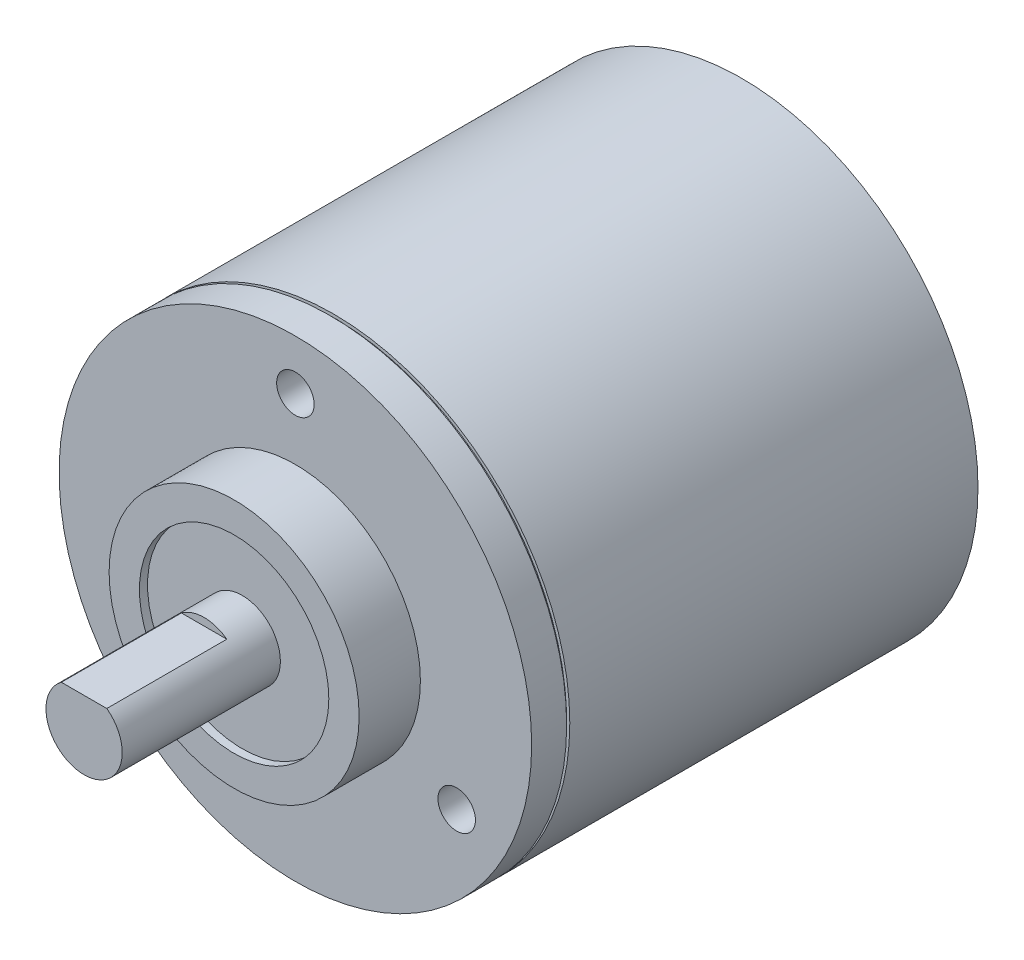
ISO-10303-21;
HEADER;
FILE_DESCRIPTION(('STEP AP214'),'2;1');
FILE_NAME('part.step','',(''),(''),'','','');
FILE_SCHEMA(('AUTOMOTIVE_DESIGN { 1 0 10303 214 1 1 1 1 }'));
ENDSEC;
DATA;
#1=APPLICATION_CONTEXT('core data for automotive mechanical design processes');
#2=APPLICATION_PROTOCOL_DEFINITION('international standard','automotive_design',2000,#1);
#3=PRODUCT_CONTEXT('',#1,'mechanical');
#4=PRODUCT('Part','Part','',(#3));
#5=PRODUCT_RELATED_PRODUCT_CATEGORY('part','',(#4));
#6=PRODUCT_DEFINITION_FORMATION('','',#4);
#7=PRODUCT_DEFINITION_CONTEXT('part definition',#1,'design');
#8=PRODUCT_DEFINITION('design','',#6,#7);
#9=PRODUCT_DEFINITION_SHAPE('','',#8);
#10=(LENGTH_UNIT() NAMED_UNIT(*) SI_UNIT(.MILLI.,.METRE.));
#11=(NAMED_UNIT(*) PLANE_ANGLE_UNIT() SI_UNIT($,.RADIAN.));
#12=(NAMED_UNIT(*) SI_UNIT($,.STERADIAN.) SOLID_ANGLE_UNIT());
#13=UNCERTAINTY_MEASURE_WITH_UNIT(LENGTH_MEASURE(1.E-05),#10,'distance_accuracy_value','');
#14=(GEOMETRIC_REPRESENTATION_CONTEXT(3) GLOBAL_UNCERTAINTY_ASSIGNED_CONTEXT((#13)) GLOBAL_UNIT_ASSIGNED_CONTEXT((#10,
#11,#12)) REPRESENTATION_CONTEXT('',''));
#15=CARTESIAN_POINT('',(0.,0.,0.));
#16=DIRECTION('',(0.,0.,1.));
#17=DIRECTION('',(1.,0.,0.));
#18=AXIS2_PLACEMENT_3D('',#15,#16,#17);
#19=CARTESIAN_POINT('',(0.,0.,-0.1));
#20=DIRECTION('',(0.,0.,1.));
#21=DIRECTION('',(1.,0.,0.));
#22=AXIS2_PLACEMENT_3D('',#19,#20,#21);
#23=CYLINDRICAL_SURFACE('',#22,18.9);
#24=CARTESIAN_POINT('',(0.,0.,32.8));
#25=DIRECTION('',(0.,0.,1.));
#26=DIRECTION('',(1.,0.,0.));
#27=AXIS2_PLACEMENT_3D('',#24,#25,#26);
#28=CIRCLE('',#27,18.9);
#29=CARTESIAN_POINT('',(18.9,0.,32.8));
#30=VERTEX_POINT('',#29);
#31=EDGE_CURVE('E39',#30,#30,#28,.F.);
#32=ORIENTED_EDGE('',*,*,#31,.F.);
#33=EDGE_LOOP('',(#32));
#34=FACE_BOUND('',#33,.T.);
#35=CARTESIAN_POINT('',(0.,0.,35.6));
#36=DIRECTION('',(0.,0.,1.));
#37=DIRECTION('',(1.,0.,0.));
#38=AXIS2_PLACEMENT_3D('',#35,#36,#37);
#39=CIRCLE('',#38,18.9);
#40=CARTESIAN_POINT('',(18.9,0.,35.6));
#41=VERTEX_POINT('',#40);
#42=EDGE_CURVE('E80',#41,#41,#39,.T.);
#43=ORIENTED_EDGE('',*,*,#42,.F.);
#44=EDGE_LOOP('',(#43));
#45=FACE_BOUND('',#44,.T.);
#46=ADVANCED_FACE('F35',(#34,#45),#23,.T.);
#47=CARTESIAN_POINT('',(0.,0.,35.6));
#48=DIRECTION('',(0.,0.,1.));
#49=DIRECTION('',(1.,0.,0.));
#50=AXIS2_PLACEMENT_3D('',#47,#48,#49);
#51=PLANE('',#50);
#52=CARTESIAN_POINT('',(-12.9037785163881,-7.45000000000006,35.6));
#53=DIRECTION('',(0.,0.,1.));
#54=DIRECTION('',(-0.500000000000004,0.866025403784436,0.));
#55=AXIS2_PLACEMENT_3D('',#52,#53,#54);
#56=CIRCLE('',#55,1.5);
#57=CARTESIAN_POINT('',(-13.6537785163881,-6.15096189432341,35.6));
#58=VERTEX_POINT('',#57);
#59=EDGE_CURVE('E113',#58,#58,#56,.T.);
#60=ORIENTED_EDGE('',*,*,#59,.F.);
#61=EDGE_LOOP('',(#60));
#62=FACE_BOUND('',#61,.T.);
#63=CARTESIAN_POINT('',(12.9037785163882,-7.44999999999988,35.6));
#64=DIRECTION('',(0.,0.,1.));
#65=DIRECTION('',(-0.499999999999992,-0.866025403784443,0.));
#66=AXIS2_PLACEMENT_3D('',#63,#64,#65);
#67=CIRCLE('',#66,1.5);
#68=CARTESIAN_POINT('',(12.1537785163882,-8.74903810567655,35.6));
#69=VERTEX_POINT('',#68);
#70=EDGE_CURVE('E102',#69,#69,#67,.T.);
#71=ORIENTED_EDGE('',*,*,#70,.F.);
#72=EDGE_LOOP('',(#71));
#73=FACE_BOUND('',#72,.T.);
#74=CARTESIAN_POINT('',(0.,14.9,35.6));
#75=DIRECTION('',(0.,0.,1.));
#76=DIRECTION('',(1.,0.,0.));
#77=AXIS2_PLACEMENT_3D('',#74,#75,#76);
#78=CIRCLE('',#77,1.5);
#79=CARTESIAN_POINT('',(1.5,14.9,35.6));
#80=VERTEX_POINT('',#79);
#81=EDGE_CURVE('E83',#80,#80,#78,.T.);
#82=ORIENTED_EDGE('',*,*,#81,.F.);
#83=EDGE_LOOP('',(#82));
#84=FACE_BOUND('',#83,.T.);
#85=CARTESIAN_POINT('',(0.,0.,35.6));
#86=DIRECTION('',(0.,0.,1.));
#87=DIRECTION('',(1.,0.,0.));
#88=AXIS2_PLACEMENT_3D('',#85,#86,#87);
#89=CIRCLE('',#88,10.);
#90=CARTESIAN_POINT('',(10.,0.,35.6));
#91=VERTEX_POINT('',#90);
#92=EDGE_CURVE('E87',#91,#91,#89,.T.);
#93=ORIENTED_EDGE('',*,*,#92,.F.);
#94=EDGE_LOOP('',(#93));
#95=FACE_BOUND('',#94,.T.);
#96=ORIENTED_EDGE('',*,*,#42,.T.);
#97=EDGE_LOOP('',(#96));
#98=FACE_BOUND('',#97,.T.);
#99=ADVANCED_FACE('F144',(#62,#73,#84,#95,#98),#51,.T.);
#100=CARTESIAN_POINT('',(0.,0.,40.5));
#101=DIRECTION('',(0.,0.,-1.));
#102=DIRECTION('',(-1.,0.,0.));
#103=AXIS2_PLACEMENT_3D('',#100,#101,#102);
#104=CYLINDRICAL_SURFACE('',#103,10.);
#105=CARTESIAN_POINT('',(0.,0.,40.5));
#106=DIRECTION('',(0.,0.,1.));
#107=DIRECTION('',(1.,0.,0.));
#108=AXIS2_PLACEMENT_3D('',#105,#106,#107);
#109=CIRCLE('',#108,10.);
#110=CARTESIAN_POINT('',(10.,0.,40.5));
#111=VERTEX_POINT('',#110);
#112=EDGE_CURVE('E76',#111,#111,#109,.T.);
#113=ORIENTED_EDGE('',*,*,#112,.F.);
#114=EDGE_LOOP('',(#113));
#115=FACE_BOUND('',#114,.T.);
#116=ORIENTED_EDGE('',*,*,#92,.T.);
#117=EDGE_LOOP('',(#116));
#118=FACE_BOUND('',#117,.T.);
#119=ADVANCED_FACE('F138',(#115,#118),#104,.T.);
#120=CARTESIAN_POINT('',(0.,0.,40.5));
#121=DIRECTION('',(0.,0.,1.));
#122=DIRECTION('',(1.,0.,0.));
#123=AXIS2_PLACEMENT_3D('',#120,#121,#122);
#124=PLANE('',#123);
#125=CARTESIAN_POINT('',(0.,0.,40.5));
#126=DIRECTION('',(0.,0.,1.));
#127=DIRECTION('',(1.,0.,0.));
#128=AXIS2_PLACEMENT_3D('',#125,#126,#127);
#129=CIRCLE('',#128,7.575);
#130=CARTESIAN_POINT('',(7.575,0.,40.5));
#131=VERTEX_POINT('',#130);
#132=EDGE_CURVE('E125',#131,#131,#129,.T.);
#133=ORIENTED_EDGE('',*,*,#132,.F.);
#134=EDGE_LOOP('',(#133));
#135=FACE_BOUND('',#134,.T.);
#136=ORIENTED_EDGE('',*,*,#112,.T.);
#137=EDGE_LOOP('',(#136));
#138=FACE_BOUND('',#137,.T.);
#139=ADVANCED_FACE('F134',(#135,#138),#124,.T.);
#140=CARTESIAN_POINT('',(0.,14.9,27.6));
#141=DIRECTION('',(0.,0.,1.));
#142=DIRECTION('',(1.,0.,0.));
#143=AXIS2_PLACEMENT_3D('',#140,#141,#142);
#144=CYLINDRICAL_SURFACE('',#143,1.5);
#145=CARTESIAN_POINT('',(0.,14.9,27.6));
#146=DIRECTION('',(0.,0.,1.));
#147=DIRECTION('',(1.,0.,0.));
#148=AXIS2_PLACEMENT_3D('',#145,#146,#147);
#149=CIRCLE('',#148,1.5);
#150=CARTESIAN_POINT('',(1.5,14.9,27.6));
#151=VERTEX_POINT('',#150);
#152=EDGE_CURVE('E77',#151,#151,#149,.T.);
#153=ORIENTED_EDGE('',*,*,#152,.F.);
#154=EDGE_LOOP('',(#153));
#155=FACE_BOUND('',#154,.T.);
#156=ORIENTED_EDGE('',*,*,#81,.T.);
#157=EDGE_LOOP('',(#156));
#158=FACE_BOUND('',#157,.T.);
#159=ADVANCED_FACE('F137',(#155,#158),#144,.F.);
#160=CARTESIAN_POINT('',(0.,14.9,27.6));
#161=DIRECTION('',(0.,0.,1.));
#162=DIRECTION('',(1.,0.,0.));
#163=AXIS2_PLACEMENT_3D('',#160,#161,#162);
#164=PLANE('',#163);
#165=ORIENTED_EDGE('',*,*,#152,.T.);
#166=EDGE_LOOP('',(#165));
#167=FACE_BOUND('',#166,.T.);
#168=ADVANCED_FACE('F182',(#167),#164,.T.);
#169=CARTESIAN_POINT('',(0.,0.,39.85));
#170=DIRECTION('',(0.,0.,1.));
#171=DIRECTION('',(1.,0.,0.));
#172=AXIS2_PLACEMENT_3D('',#169,#170,#171);
#173=CYLINDRICAL_SURFACE('',#172,7.575);
#174=CARTESIAN_POINT('',(0.,0.,39.85));
#175=DIRECTION('',(0.,0.,1.));
#176=DIRECTION('',(1.,0.,0.));
#177=AXIS2_PLACEMENT_3D('',#174,#175,#176);
#178=CIRCLE('',#177,7.575);
#179=CARTESIAN_POINT('',(7.575,0.,39.85));
#180=VERTEX_POINT('',#179);
#181=EDGE_CURVE('E126',#180,#180,#178,.T.);
#182=ORIENTED_EDGE('',*,*,#181,.F.);
#183=EDGE_LOOP('',(#182));
#184=FACE_BOUND('',#183,.T.);
#185=ORIENTED_EDGE('',*,*,#132,.T.);
#186=EDGE_LOOP('',(#185));
#187=FACE_BOUND('',#186,.T.);
#188=ADVANCED_FACE('F132',(#184,#187),#173,.F.);
#189=CARTESIAN_POINT('',(0.,0.,39.85));
#190=DIRECTION('',(0.,0.,1.));
#191=DIRECTION('',(1.,0.,0.));
#192=AXIS2_PLACEMENT_3D('',#189,#190,#191);
#193=PLANE('',#192);
#194=CARTESIAN_POINT('',(0.,0.,39.85));
#195=DIRECTION('',(0.,0.,1.));
#196=DIRECTION('',(1.,0.,0.));
#197=AXIS2_PLACEMENT_3D('',#194,#195,#196);
#198=CIRCLE('',#197,3.05);
#199=CARTESIAN_POINT('',(3.05,0.,39.85));
#200=VERTEX_POINT('',#199);
#201=EDGE_CURVE('E121',#200,#200,#198,.T.);
#202=ORIENTED_EDGE('',*,*,#201,.F.);
#203=EDGE_LOOP('',(#202));
#204=FACE_BOUND('',#203,.T.);
#205=ORIENTED_EDGE('',*,*,#181,.T.);
#206=EDGE_LOOP('',(#205));
#207=FACE_BOUND('',#206,.T.);
#208=ADVANCED_FACE('F179',(#204,#207),#193,.T.);
#209=CARTESIAN_POINT('',(0.,0.,52.5));
#210=DIRECTION('',(0.,0.,1.));
#211=DIRECTION('',(1.,0.,0.));
#212=AXIS2_PLACEMENT_3D('',#209,#210,#211);
#213=PLANE('',#212);
#214=DIRECTION('',(1.,0.,0.));
#215=VECTOR('',#214,1.);
#216=CARTESIAN_POINT('',(-4.31706966346971,2.45,52.5));
#217=LINE('',#216,#215);
#218=CARTESIAN_POINT('',(-1.81659021245849,2.45,52.5));
#219=VERTEX_POINT('',#218);
#220=CARTESIAN_POINT('',(1.81659021245849,2.45,52.5));
#221=VERTEX_POINT('',#220);
#222=EDGE_CURVE('E64',#219,#221,#217,.T.);
#223=ORIENTED_EDGE('',*,*,#222,.F.);
#224=CARTESIAN_POINT('',(0.,0.,52.5));
#225=DIRECTION('',(0.,0.,1.));
#226=DIRECTION('',(1.,0.,0.));
#227=AXIS2_PLACEMENT_3D('',#224,#225,#226);
#228=CIRCLE('',#227,3.05);
#229=EDGE_CURVE('E71',#219,#221,#228,.T.);
#230=ORIENTED_EDGE('',*,*,#229,.T.);
#231=EDGE_LOOP('',(#223,#230));
#232=FACE_BOUND('',#231,.T.);
#233=ADVANCED_FACE('F70',(#232),#213,.T.);
#234=CARTESIAN_POINT('',(0.,0.,52.5));
#235=DIRECTION('',(0.,0.,-1.));
#236=DIRECTION('',(-1.,0.,0.));
#237=AXIS2_PLACEMENT_3D('',#234,#235,#236);
#238=CYLINDRICAL_SURFACE('',#237,3.05);
#239=ORIENTED_EDGE('',*,*,#229,.F.);
#240=DIRECTION('',(0.,0.,-1.));
#241=VECTOR('',#240,1.);
#242=CARTESIAN_POINT('',(-1.81659021245849,2.45,52.5));
#243=LINE('',#242,#241);
#244=CARTESIAN_POINT('',(-1.81659021245849,2.45,42.9));
#245=VERTEX_POINT('',#244);
#246=EDGE_CURVE('E11',#219,#245,#243,.T.);
#247=ORIENTED_EDGE('',*,*,#246,.T.);
#248=CARTESIAN_POINT('',(0.,0.,42.9));
#249=DIRECTION('',(0.,0.,1.));
#250=DIRECTION('',(1.,0.,0.));
#251=AXIS2_PLACEMENT_3D('',#248,#249,#250);
#252=CIRCLE('',#251,3.05);
#253=CARTESIAN_POINT('',(1.81659021245849,2.45,42.9));
#254=VERTEX_POINT('',#253);
#255=EDGE_CURVE('E55',#254,#245,#252,.T.);
#256=ORIENTED_EDGE('',*,*,#255,.F.);
#257=DIRECTION('',(0.,0.,-1.));
#258=VECTOR('',#257,1.);
#259=CARTESIAN_POINT('',(1.81659021245849,2.45,52.5));
#260=LINE('',#259,#258);
#261=EDGE_CURVE('E44',#254,#221,#260,.F.);
#262=ORIENTED_EDGE('',*,*,#261,.T.);
#263=EDGE_LOOP('',(#239,#247,#256,#262));
#264=FACE_BOUND('',#263,.T.);
#265=ORIENTED_EDGE('',*,*,#201,.T.);
#266=EDGE_LOOP('',(#265));
#267=FACE_BOUND('',#266,.T.);
#268=ADVANCED_FACE('F74',(#264,#267),#238,.T.);
#269=CARTESIAN_POINT('',(-4.31706966346971,2.45,42.9));
#270=DIRECTION('',(0.,-1.,0.));
#271=DIRECTION('',(0.,0.,-1.));
#272=AXIS2_PLACEMENT_3D('',#269,#270,#271);
#273=PLANE('',#272);
#274=ORIENTED_EDGE('',*,*,#222,.T.);
#275=ORIENTED_EDGE('',*,*,#261,.F.);
#276=DIRECTION('',(1.,0.,0.));
#277=VECTOR('',#276,1.);
#278=CARTESIAN_POINT('',(-4.31706966346971,2.45,42.9));
#279=LINE('',#278,#277);
#280=EDGE_CURVE('E51',#245,#254,#279,.T.);
#281=ORIENTED_EDGE('',*,*,#280,.F.);
#282=ORIENTED_EDGE('',*,*,#246,.F.);
#283=EDGE_LOOP('',(#274,#275,#281,#282));
#284=FACE_BOUND('',#283,.T.);
#285=ADVANCED_FACE('F63',(#284),#273,.F.);
#286=CARTESIAN_POINT('',(0.,0.,42.9));
#287=DIRECTION('',(0.,0.,1.));
#288=DIRECTION('',(1.,0.,0.));
#289=AXIS2_PLACEMENT_3D('',#286,#287,#288);
#290=PLANE('',#289);
#291=ORIENTED_EDGE('',*,*,#255,.T.);
#292=ORIENTED_EDGE('',*,*,#280,.T.);
#293=EDGE_LOOP('',(#291,#292));
#294=FACE_BOUND('',#293,.T.);
#295=ADVANCED_FACE('F195',(#294),#290,.T.);
#296=CARTESIAN_POINT('',(12.9037785163882,-7.44999999999988,27.6));
#297=DIRECTION('',(0.,0.,1.));
#298=DIRECTION('',(1.,0.,0.));
#299=AXIS2_PLACEMENT_3D('',#296,#297,#298);
#300=CYLINDRICAL_SURFACE('',#299,1.5);
#301=CARTESIAN_POINT('',(12.9037785163882,-7.44999999999988,27.6));
#302=DIRECTION('',(0.,0.,1.));
#303=DIRECTION('',(-0.499999999999992,-0.866025403784443,0.));
#304=AXIS2_PLACEMENT_3D('',#301,#302,#303);
#305=CIRCLE('',#304,1.5);
#306=CARTESIAN_POINT('',(12.1537785163882,-8.74903810567655,27.6));
#307=VERTEX_POINT('',#306);
#308=EDGE_CURVE('E116',#307,#307,#305,.T.);
#309=ORIENTED_EDGE('',*,*,#308,.F.);
#310=EDGE_LOOP('',(#309));
#311=FACE_BOUND('',#310,.T.);
#312=ORIENTED_EDGE('',*,*,#70,.T.);
#313=EDGE_LOOP('',(#312));
#314=FACE_BOUND('',#313,.T.);
#315=ADVANCED_FACE('F198',(#311,#314),#300,.F.);
#316=CARTESIAN_POINT('',(12.9037785163882,-7.44999999999988,27.6));
#317=DIRECTION('',(0.,0.,1.));
#318=DIRECTION('',(-0.499999999999992,-0.866025403784443,0.));
#319=AXIS2_PLACEMENT_3D('',#316,#317,#318);
#320=PLANE('',#319);
#321=ORIENTED_EDGE('',*,*,#308,.T.);
#322=EDGE_LOOP('',(#321));
#323=FACE_BOUND('',#322,.T.);
#324=ADVANCED_FACE('F201',(#323),#320,.T.);
#325=CARTESIAN_POINT('',(-12.9037785163881,-7.45000000000006,27.6));
#326=DIRECTION('',(0.,0.,1.));
#327=DIRECTION('',(1.,0.,0.));
#328=AXIS2_PLACEMENT_3D('',#325,#326,#327);
#329=CYLINDRICAL_SURFACE('',#328,1.5);
#330=CARTESIAN_POINT('',(-12.9037785163881,-7.45000000000006,27.6));
#331=DIRECTION('',(0.,0.,1.));
#332=DIRECTION('',(-0.500000000000004,0.866025403784436,0.));
#333=AXIS2_PLACEMENT_3D('',#330,#331,#332);
#334=CIRCLE('',#333,1.5);
#335=CARTESIAN_POINT('',(-13.6537785163881,-6.15096189432341,27.6));
#336=VERTEX_POINT('',#335);
#337=EDGE_CURVE('E72',#336,#336,#334,.T.);
#338=ORIENTED_EDGE('',*,*,#337,.F.);
#339=EDGE_LOOP('',(#338));
#340=FACE_BOUND('',#339,.T.);
#341=ORIENTED_EDGE('',*,*,#59,.T.);
#342=EDGE_LOOP('',(#341));
#343=FACE_BOUND('',#342,.T.);
#344=ADVANCED_FACE('F205',(#340,#343),#329,.F.);
#345=CARTESIAN_POINT('',(-12.9037785163881,-7.45000000000006,27.6));
#346=DIRECTION('',(0.,0.,1.));
#347=DIRECTION('',(-0.500000000000004,0.866025403784436,0.));
#348=AXIS2_PLACEMENT_3D('',#345,#346,#347);
#349=PLANE('',#348);
#350=ORIENTED_EDGE('',*,*,#337,.T.);
#351=EDGE_LOOP('',(#350));
#352=FACE_BOUND('',#351,.T.);
#353=ADVANCED_FACE('F209',(#352),#349,.T.);
#354=CARTESIAN_POINT('',(0.,21.8461649379907,32.8));
#355=DIRECTION('',(0.,0.,1.));
#356=DIRECTION('',(1.,0.,0.));
#357=AXIS2_PLACEMENT_3D('',#354,#355,#356);
#358=PLANE('',#357);
#359=ORIENTED_EDGE('',*,*,#31,.T.);
#360=EDGE_LOOP('',(#359));
#361=FACE_BOUND('',#360,.T.);
#362=CARTESIAN_POINT('',(0.,0.,32.8));
#363=DIRECTION('',(0.,0.,-1.));
#364=DIRECTION('',(-1.,0.,0.));
#365=AXIS2_PLACEMENT_3D('',#362,#363,#364);
#366=CIRCLE('',#365,18.65);
#367=CARTESIAN_POINT('',(-18.65,0.,32.8));
#368=VERTEX_POINT('',#367);
#369=EDGE_CURVE('E98',#368,#368,#366,.T.);
#370=ORIENTED_EDGE('',*,*,#369,.F.);
#371=EDGE_LOOP('',(#370));
#372=FACE_BOUND('',#371,.T.);
#373=ADVANCED_FACE('F213',(#361,#372),#358,.F.);
#374=CARTESIAN_POINT('',(0.,0.,-0.1));
#375=DIRECTION('',(0.,0.,-1.));
#376=DIRECTION('',(-1.,0.,0.));
#377=AXIS2_PLACEMENT_3D('',#374,#375,#376);
#378=CYLINDRICAL_SURFACE('',#377,18.65);
#379=CARTESIAN_POINT('',(0.,0.,32.55));
#380=DIRECTION('',(0.,0.,-1.));
#381=DIRECTION('',(-1.,0.,0.));
#382=AXIS2_PLACEMENT_3D('',#379,#380,#381);
#383=CIRCLE('',#382,18.65);
#384=CARTESIAN_POINT('',(-18.65,0.,32.55));
#385=VERTEX_POINT('',#384);
#386=EDGE_CURVE('E104',#385,#385,#383,.T.);
#387=ORIENTED_EDGE('',*,*,#386,.F.);
#388=EDGE_LOOP('',(#387));
#389=FACE_BOUND('',#388,.T.);
#390=ORIENTED_EDGE('',*,*,#369,.T.);
#391=EDGE_LOOP('',(#390));
#392=FACE_BOUND('',#391,.T.);
#393=ADVANCED_FACE('F172',(#389,#392),#378,.T.);
#394=CARTESIAN_POINT('',(0.,21.8461649379907,32.55));
#395=DIRECTION('',(0.,0.,-1.));
#396=DIRECTION('',(-1.,0.,0.));
#397=AXIS2_PLACEMENT_3D('',#394,#395,#396);
#398=PLANE('',#397);
#399=CARTESIAN_POINT('',(0.,0.,32.55));
#400=DIRECTION('',(0.,0.,-1.));
#401=DIRECTION('',(-1.,0.,0.));
#402=AXIS2_PLACEMENT_3D('',#399,#400,#401);
#403=CIRCLE('',#402,18.9);
#404=CARTESIAN_POINT('',(-18.9,0.,32.55));
#405=VERTEX_POINT('',#404);
#406=EDGE_CURVE('E96',#405,#405,#403,.F.);
#407=ORIENTED_EDGE('',*,*,#406,.T.);
#408=EDGE_LOOP('',(#407));
#409=FACE_BOUND('',#408,.T.);
#410=ORIENTED_EDGE('',*,*,#386,.T.);
#411=EDGE_LOOP('',(#410));
#412=FACE_BOUND('',#411,.T.);
#413=ADVANCED_FACE('F165',(#409,#412),#398,.F.);
#414=CARTESIAN_POINT('',(0.,0.,-0.1));
#415=DIRECTION('',(0.,0.,1.));
#416=DIRECTION('',(1.,0.,0.));
#417=AXIS2_PLACEMENT_3D('',#414,#415,#416);
#418=PLANE('',#417);
#419=CARTESIAN_POINT('',(0.,0.,-0.1));
#420=DIRECTION('',(0.,0.,1.));
#421=DIRECTION('',(1.,0.,0.));
#422=AXIS2_PLACEMENT_3D('',#419,#420,#421);
#423=CIRCLE('',#422,18.9);
#424=CARTESIAN_POINT('',(18.9,0.,-0.1));
#425=VERTEX_POINT('',#424);
#426=EDGE_CURVE('E90',#425,#425,#423,.T.);
#427=ORIENTED_EDGE('',*,*,#426,.F.);
#428=EDGE_LOOP('',(#427));
#429=FACE_BOUND('',#428,.T.);
#430=ADVANCED_FACE('F160',(#429),#418,.F.);
#431=ORIENTED_EDGE('',*,*,#406,.F.);
#432=EDGE_LOOP('',(#431));
#433=FACE_BOUND('',#432,.T.);
#434=ORIENTED_EDGE('',*,*,#426,.T.);
#435=EDGE_LOOP('',(#434));
#436=FACE_BOUND('',#435,.T.);
#437=ADVANCED_FACE('F37',(#433,#436),#23,.T.);
#438=CLOSED_SHELL('',(#46,#99,#119,#139,#159,#168,#188,#208,#233,#268,#285,#295,#315,#324,#344,
#353,#373,#393,#413,#430,#437));
#439=MANIFOLD_SOLID_BREP('B2',#438);
#440=ADVANCED_BREP_SHAPE_REPRESENTATION('',(#18,#439),#14);
#441=SHAPE_DEFINITION_REPRESENTATION(#9,#440);
ENDSEC;
END-ISO-10303-21;
